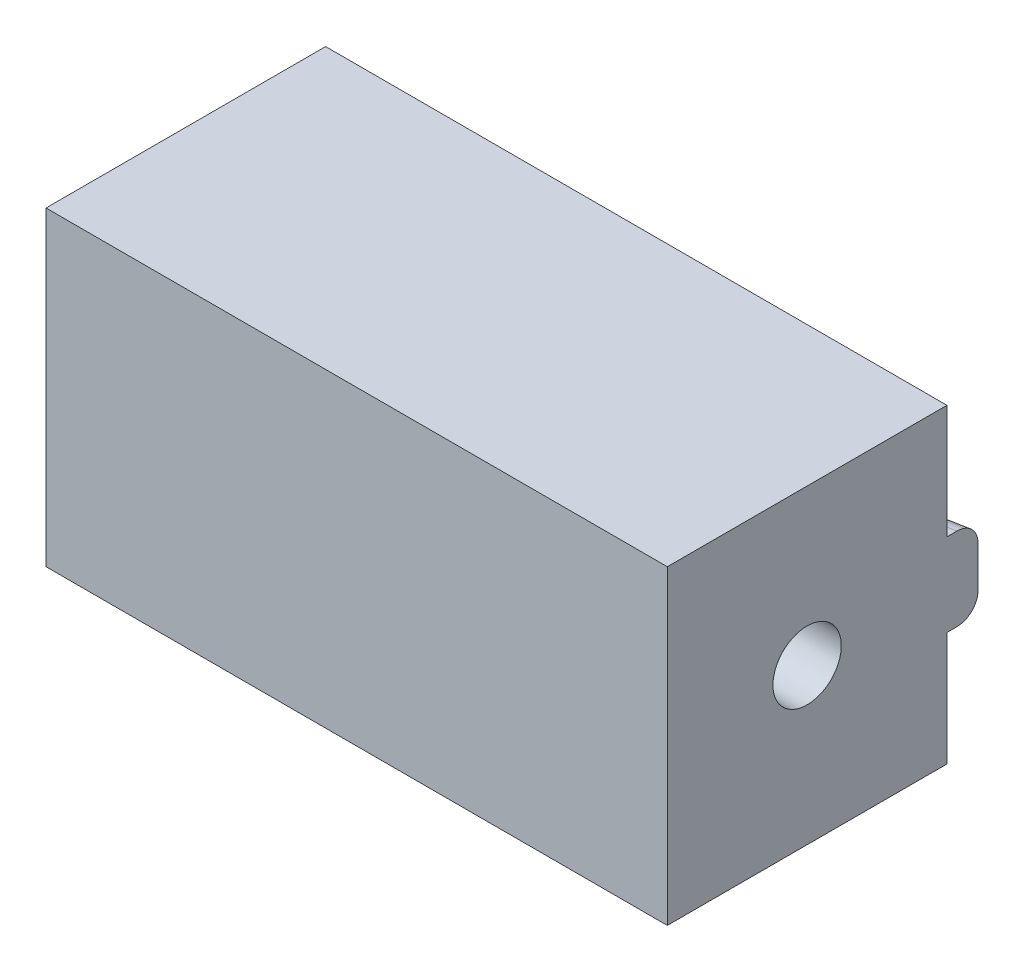
ISO-10303-21;
HEADER;
FILE_DESCRIPTION(('STEP AP214'),'2;1');
FILE_NAME('part.step','',(''),(''),'','','');
FILE_SCHEMA(('AUTOMOTIVE_DESIGN { 1 0 10303 214 1 1 1 1 }'));
ENDSEC;
DATA;
#1=APPLICATION_CONTEXT('core data for automotive mechanical design processes');
#2=APPLICATION_PROTOCOL_DEFINITION('international standard','automotive_design',2000,#1);
#3=PRODUCT_CONTEXT('',#1,'mechanical');
#4=PRODUCT('Part','Part','',(#3));
#5=PRODUCT_RELATED_PRODUCT_CATEGORY('part','',(#4));
#6=PRODUCT_DEFINITION_FORMATION('','',#4);
#7=PRODUCT_DEFINITION_CONTEXT('part definition',#1,'design');
#8=PRODUCT_DEFINITION('design','',#6,#7);
#9=PRODUCT_DEFINITION_SHAPE('','',#8);
#10=(LENGTH_UNIT() NAMED_UNIT(*) SI_UNIT(.MILLI.,.METRE.));
#11=(NAMED_UNIT(*) PLANE_ANGLE_UNIT() SI_UNIT($,.RADIAN.));
#12=(NAMED_UNIT(*) SI_UNIT($,.STERADIAN.) SOLID_ANGLE_UNIT());
#13=UNCERTAINTY_MEASURE_WITH_UNIT(LENGTH_MEASURE(1.E-05),#10,'distance_accuracy_value','');
#14=(GEOMETRIC_REPRESENTATION_CONTEXT(3) GLOBAL_UNCERTAINTY_ASSIGNED_CONTEXT((#13)) GLOBAL_UNIT_ASSIGNED_CONTEXT((#10,
#11,#12)) REPRESENTATION_CONTEXT('',''));
#15=CARTESIAN_POINT('',(0.,0.,0.));
#16=DIRECTION('',(0.,0.,1.));
#17=DIRECTION('',(1.,0.,0.));
#18=AXIS2_PLACEMENT_3D('',#15,#16,#17);
#19=CARTESIAN_POINT('',(0.,0.,-6.75));
#20=DIRECTION('',(0.,0.,-1.));
#21=DIRECTION('',(-1.,0.,0.));
#22=AXIS2_PLACEMENT_3D('',#19,#20,#21);
#23=PLANE('',#22);
#24=DIRECTION('',(1.,0.,0.));
#25=VECTOR('',#24,1.);
#26=CARTESIAN_POINT('',(22.,2.,-6.75));
#27=LINE('',#26,#25);
#28=CARTESIAN_POINT('',(27.4262735320332,2.,-6.75));
#29=VERTEX_POINT('',#28);
#30=CARTESIAN_POINT('',(30.,2.,-6.75));
#31=VERTEX_POINT('',#30);
#32=EDGE_CURVE('E111',#29,#31,#27,.T.);
#33=ORIENTED_EDGE('',*,*,#32,.F.);
#34=CARTESIAN_POINT('',(27.4262735320332,1.,-6.75));
#35=DIRECTION('',(0.,0.,-1.));
#36=DIRECTION('',(1.,0.,0.));
#37=AXIS2_PLACEMENT_3D('',#34,#35,#36);
#38=ELLIPSE('',#37,5.42627353203323,1.);
#39=CARTESIAN_POINT('',(22.,1.,-6.75));
#40=VERTEX_POINT('',#39);
#41=EDGE_CURVE('E48',#29,#40,#38,.F.);
#42=ORIENTED_EDGE('',*,*,#41,.T.);
#43=DIRECTION('',(0.,-1.,0.));
#44=VECTOR('',#43,1.);
#45=CARTESIAN_POINT('',(22.,2.,-6.75));
#46=LINE('',#45,#44);
#47=CARTESIAN_POINT('',(22.,-1.,-6.75));
#48=VERTEX_POINT('',#47);
#49=EDGE_CURVE('E130',#40,#48,#46,.T.);
#50=ORIENTED_EDGE('',*,*,#49,.T.);
#51=CARTESIAN_POINT('',(27.4262735320332,-1.,-6.75));
#52=DIRECTION('',(0.,0.,-1.));
#53=DIRECTION('',(-1.,0.,0.));
#54=AXIS2_PLACEMENT_3D('',#51,#52,#53);
#55=ELLIPSE('',#54,5.42627353203323,1.);
#56=CARTESIAN_POINT('',(27.4262735320332,-2.,-6.75));
#57=VERTEX_POINT('',#56);
#58=EDGE_CURVE('E11',#48,#57,#55,.F.);
#59=ORIENTED_EDGE('',*,*,#58,.T.);
#60=DIRECTION('',(1.,0.,0.));
#61=VECTOR('',#60,1.);
#62=CARTESIAN_POINT('',(22.,-2.,-6.75));
#63=LINE('',#62,#61);
#64=CARTESIAN_POINT('',(30.,-2.,-6.75));
#65=VERTEX_POINT('',#64);
#66=EDGE_CURVE('E239',#57,#65,#63,.T.);
#67=ORIENTED_EDGE('',*,*,#66,.T.);
#68=DIRECTION('',(0.,1.,0.));
#69=VECTOR('',#68,1.);
#70=CARTESIAN_POINT('',(30.,-7.5,-6.75));
#71=LINE('',#70,#69);
#72=CARTESIAN_POINT('',(30.,-7.5,-6.75));
#73=VERTEX_POINT('',#72);
#74=EDGE_CURVE('E136',#73,#65,#71,.T.);
#75=ORIENTED_EDGE('',*,*,#74,.F.);
#76=DIRECTION('',(1.,0.,0.));
#77=VECTOR('',#76,1.);
#78=CARTESIAN_POINT('',(0.,-7.5,-6.75));
#79=LINE('',#78,#77);
#80=CARTESIAN_POINT('',(0.,-7.5,-6.75));
#81=VERTEX_POINT('',#80);
#82=EDGE_CURVE('E137',#81,#73,#79,.T.);
#83=ORIENTED_EDGE('',*,*,#82,.F.);
#84=DIRECTION('',(0.,-1.,0.));
#85=VECTOR('',#84,1.);
#86=CARTESIAN_POINT('',(0.,-7.5,-6.75));
#87=LINE('',#86,#85);
#88=CARTESIAN_POINT('',(0.,7.5,-6.75));
#89=VERTEX_POINT('',#88);
#90=EDGE_CURVE('E142',#89,#81,#87,.T.);
#91=ORIENTED_EDGE('',*,*,#90,.F.);
#92=DIRECTION('',(-1.,0.,0.));
#93=VECTOR('',#92,1.);
#94=CARTESIAN_POINT('',(0.,7.5,-6.75));
#95=LINE('',#94,#93);
#96=CARTESIAN_POINT('',(30.,7.5,-6.75));
#97=VERTEX_POINT('',#96);
#98=EDGE_CURVE('E134',#97,#89,#95,.T.);
#99=ORIENTED_EDGE('',*,*,#98,.F.);
#100=EDGE_CURVE('E125',#31,#97,#71,.T.);
#101=ORIENTED_EDGE('',*,*,#100,.F.);
#102=EDGE_LOOP('',(#33,#42,#50,#59,#67,#75,#83,#91,#99,#101));
#103=FACE_BOUND('',#102,.T.);
#104=ADVANCED_FACE('F39',(#103),#23,.T.);
#105=CARTESIAN_POINT('',(0.,-7.5,6.75));
#106=DIRECTION('',(1.,0.,0.));
#107=DIRECTION('',(0.,1.,0.));
#108=AXIS2_PLACEMENT_3D('',#105,#106,#107);
#109=PLANE('',#108);
#110=CARTESIAN_POINT('',(0.,0.,0.));
#111=DIRECTION('',(-1.,0.,0.));
#112=DIRECTION('',(0.,0.,1.));
#113=AXIS2_PLACEMENT_3D('',#110,#111,#112);
#114=CIRCLE('',#113,3.);
#115=CARTESIAN_POINT('',(0.,0.,3.));
#116=VERTEX_POINT('',#115);
#117=EDGE_CURVE('E241',#116,#116,#114,.T.);
#118=ORIENTED_EDGE('',*,*,#117,.F.);
#119=EDGE_LOOP('',(#118));
#120=FACE_BOUND('',#119,.T.);
#121=ORIENTED_EDGE('',*,*,#90,.T.);
#122=DIRECTION('',(0.,0.,-1.));
#123=VECTOR('',#122,1.);
#124=CARTESIAN_POINT('',(0.,-7.5,6.75));
#125=LINE('',#124,#123);
#126=CARTESIAN_POINT('',(0.,-7.5,6.75));
#127=VERTEX_POINT('',#126);
#128=EDGE_CURVE('E161',#127,#81,#125,.T.);
#129=ORIENTED_EDGE('',*,*,#128,.F.);
#130=DIRECTION('',(0.,-1.,0.));
#131=VECTOR('',#130,1.);
#132=CARTESIAN_POINT('',(0.,-7.5,6.75));
#133=LINE('',#132,#131);
#134=CARTESIAN_POINT('',(0.,7.5,6.75));
#135=VERTEX_POINT('',#134);
#136=EDGE_CURVE('E148',#135,#127,#133,.T.);
#137=ORIENTED_EDGE('',*,*,#136,.F.);
#138=DIRECTION('',(0.,0.,-1.));
#139=VECTOR('',#138,1.);
#140=CARTESIAN_POINT('',(0.,7.5,6.75));
#141=LINE('',#140,#139);
#142=EDGE_CURVE('E149',#135,#89,#141,.T.);
#143=ORIENTED_EDGE('',*,*,#142,.T.);
#144=EDGE_LOOP('',(#121,#129,#137,#143));
#145=FACE_BOUND('',#144,.T.);
#146=ADVANCED_FACE('F203',(#120,#145),#109,.F.);
#147=CARTESIAN_POINT('',(0.,-7.5,6.75));
#148=DIRECTION('',(0.,1.,0.));
#149=DIRECTION('',(0.,0.,1.));
#150=AXIS2_PLACEMENT_3D('',#147,#148,#149);
#151=PLANE('',#150);
#152=CARTESIAN_POINT('',(8.,-7.5,0.));
#153=DIRECTION('',(0.,-1.,0.));
#154=DIRECTION('',(0.,0.,-1.));
#155=AXIS2_PLACEMENT_3D('',#152,#153,#154);
#156=CIRCLE('',#155,1.5);
#157=CARTESIAN_POINT('',(8.,-7.5,-1.5));
#158=VERTEX_POINT('',#157);
#159=EDGE_CURVE('E228',#158,#158,#156,.T.);
#160=ORIENTED_EDGE('',*,*,#159,.F.);
#161=EDGE_LOOP('',(#160));
#162=FACE_BOUND('',#161,.T.);
#163=CARTESIAN_POINT('',(23.,-7.5,0.));
#164=DIRECTION('',(0.,-1.,0.));
#165=DIRECTION('',(0.,0.,-1.));
#166=AXIS2_PLACEMENT_3D('',#163,#164,#165);
#167=CIRCLE('',#166,1.5);
#168=CARTESIAN_POINT('',(23.,-7.5,-1.5));
#169=VERTEX_POINT('',#168);
#170=EDGE_CURVE('E232',#169,#169,#167,.T.);
#171=ORIENTED_EDGE('',*,*,#170,.F.);
#172=EDGE_LOOP('',(#171));
#173=FACE_BOUND('',#172,.T.);
#174=ORIENTED_EDGE('',*,*,#82,.T.);
#175=DIRECTION('',(0.,0.,-1.));
#176=VECTOR('',#175,1.);
#177=CARTESIAN_POINT('',(30.,-7.5,6.75));
#178=LINE('',#177,#176);
#179=CARTESIAN_POINT('',(30.,-7.5,6.75));
#180=VERTEX_POINT('',#179);
#181=EDGE_CURVE('E157',#180,#73,#178,.T.);
#182=ORIENTED_EDGE('',*,*,#181,.F.);
#183=DIRECTION('',(1.,0.,0.));
#184=VECTOR('',#183,1.);
#185=CARTESIAN_POINT('',(0.,-7.5,6.75));
#186=LINE('',#185,#184);
#187=EDGE_CURVE('E264',#127,#180,#186,.T.);
#188=ORIENTED_EDGE('',*,*,#187,.F.);
#189=ORIENTED_EDGE('',*,*,#128,.T.);
#190=EDGE_LOOP('',(#174,#182,#188,#189));
#191=FACE_BOUND('',#190,.T.);
#192=ADVANCED_FACE('F208',(#162,#173,#191),#151,.F.);
#193=CARTESIAN_POINT('',(30.,-7.5,6.75));
#194=DIRECTION('',(-1.,0.,0.));
#195=DIRECTION('',(0.,0.,1.));
#196=AXIS2_PLACEMENT_3D('',#193,#194,#195);
#197=PLANE('',#196);
#198=CARTESIAN_POINT('',(30.,0.,0.));
#199=DIRECTION('',(-1.,0.,0.));
#200=DIRECTION('',(0.,0.,1.));
#201=AXIS2_PLACEMENT_3D('',#198,#199,#200);
#202=CIRCLE('',#201,1.65);
#203=CARTESIAN_POINT('',(30.,0.,1.65));
#204=VERTEX_POINT('',#203);
#205=EDGE_CURVE('E321',#204,#204,#202,.T.);
#206=ORIENTED_EDGE('',*,*,#205,.T.);
#207=EDGE_LOOP('',(#206));
#208=FACE_BOUND('',#207,.T.);
#209=DIRECTION('',(0.,-1.,0.));
#210=VECTOR('',#209,1.);
#211=CARTESIAN_POINT('',(30.,2.,-8.25));
#212=LINE('',#211,#210);
#213=CARTESIAN_POINT('',(30.,1.,-8.25));
#214=VERTEX_POINT('',#213);
#215=CARTESIAN_POINT('',(30.,-1.,-8.25));
#216=VERTEX_POINT('',#215);
#217=EDGE_CURVE('E189',#214,#216,#212,.T.);
#218=ORIENTED_EDGE('',*,*,#217,.F.);
#219=CARTESIAN_POINT('',(30.,1.,-7.23257371274377));
#220=DIRECTION('',(-1.,0.,0.));
#221=DIRECTION('',(0.,0.,-1.));
#222=AXIS2_PLACEMENT_3D('',#219,#220,#221);
#223=ELLIPSE('',#222,1.01742628725623,1.);
#224=CARTESIAN_POINT('',(30.,2.,-7.23257371274377));
#225=VERTEX_POINT('',#224);
#226=EDGE_CURVE('E128',#214,#225,#223,.F.);
#227=ORIENTED_EDGE('',*,*,#226,.T.);
#228=DIRECTION('',(0.,0.,-1.));
#229=VECTOR('',#228,1.);
#230=CARTESIAN_POINT('',(30.,2.,-6.75));
#231=LINE('',#230,#229);
#232=EDGE_CURVE('E114',#31,#225,#231,.T.);
#233=ORIENTED_EDGE('',*,*,#232,.F.);
#234=ORIENTED_EDGE('',*,*,#100,.T.);
#235=DIRECTION('',(0.,0.,-1.));
#236=VECTOR('',#235,1.);
#237=CARTESIAN_POINT('',(30.,7.5,6.75));
#238=LINE('',#237,#236);
#239=CARTESIAN_POINT('',(30.,7.5,6.75));
#240=VERTEX_POINT('',#239);
#241=EDGE_CURVE('E153',#240,#97,#238,.T.);
#242=ORIENTED_EDGE('',*,*,#241,.F.);
#243=DIRECTION('',(0.,1.,0.));
#244=VECTOR('',#243,1.);
#245=CARTESIAN_POINT('',(30.,-7.5,6.75));
#246=LINE('',#245,#244);
#247=EDGE_CURVE('E238',#180,#240,#246,.T.);
#248=ORIENTED_EDGE('',*,*,#247,.F.);
#249=ORIENTED_EDGE('',*,*,#181,.T.);
#250=ORIENTED_EDGE('',*,*,#74,.T.);
#251=DIRECTION('',(0.,0.,-1.));
#252=VECTOR('',#251,1.);
#253=CARTESIAN_POINT('',(30.,-2.,-6.75));
#254=LINE('',#253,#252);
#255=CARTESIAN_POINT('',(30.,-2.,-7.23257371274377));
#256=VERTEX_POINT('',#255);
#257=EDGE_CURVE('E119',#65,#256,#254,.T.);
#258=ORIENTED_EDGE('',*,*,#257,.T.);
#259=CARTESIAN_POINT('',(30.,-1.,-7.23257371274377));
#260=DIRECTION('',(-1.,0.,0.));
#261=DIRECTION('',(0.,0.,1.));
#262=AXIS2_PLACEMENT_3D('',#259,#260,#261);
#263=ELLIPSE('',#262,1.01742628725623,1.);
#264=EDGE_CURVE('E174',#256,#216,#263,.F.);
#265=ORIENTED_EDGE('',*,*,#264,.T.);
#266=EDGE_LOOP('',(#218,#227,#233,#234,#242,#248,#249,#250,#258,#265));
#267=FACE_BOUND('',#266,.T.);
#268=ADVANCED_FACE('F123',(#208,#267),#197,.F.);
#269=CARTESIAN_POINT('',(0.,7.5,6.75));
#270=DIRECTION('',(0.,-1.,0.));
#271=DIRECTION('',(1.,0.,0.));
#272=AXIS2_PLACEMENT_3D('',#269,#270,#271);
#273=PLANE('',#272);
#274=ORIENTED_EDGE('',*,*,#98,.T.);
#275=ORIENTED_EDGE('',*,*,#142,.F.);
#276=DIRECTION('',(-1.,0.,0.));
#277=VECTOR('',#276,1.);
#278=CARTESIAN_POINT('',(0.,7.5,6.75));
#279=LINE('',#278,#277);
#280=EDGE_CURVE('E154',#240,#135,#279,.T.);
#281=ORIENTED_EDGE('',*,*,#280,.F.);
#282=ORIENTED_EDGE('',*,*,#241,.T.);
#283=EDGE_LOOP('',(#274,#275,#281,#282));
#284=FACE_BOUND('',#283,.T.);
#285=ADVANCED_FACE('F214',(#284),#273,.F.);
#286=CARTESIAN_POINT('',(0.,0.,6.75));
#287=DIRECTION('',(0.,0.,-1.));
#288=DIRECTION('',(-1.,0.,0.));
#289=AXIS2_PLACEMENT_3D('',#286,#287,#288);
#290=PLANE('',#289);
#291=ORIENTED_EDGE('',*,*,#136,.T.);
#292=ORIENTED_EDGE('',*,*,#187,.T.);
#293=ORIENTED_EDGE('',*,*,#247,.T.);
#294=ORIENTED_EDGE('',*,*,#280,.T.);
#295=EDGE_LOOP('',(#291,#292,#293,#294));
#296=FACE_BOUND('',#295,.T.);
#297=ADVANCED_FACE('F212',(#296),#290,.F.);
#298=CARTESIAN_POINT('',(23.,-4.5,0.));
#299=DIRECTION('',(0.,-1.,0.));
#300=DIRECTION('',(0.,0.,-1.));
#301=AXIS2_PLACEMENT_3D('',#298,#299,#300);
#302=CYLINDRICAL_SURFACE('',#301,1.5);
#303=CARTESIAN_POINT('',(23.,-4.5,0.));
#304=DIRECTION('',(0.,-1.,0.));
#305=DIRECTION('',(0.,0.,-1.));
#306=AXIS2_PLACEMENT_3D('',#303,#304,#305);
#307=CIRCLE('',#306,1.5);
#308=CARTESIAN_POINT('',(23.,-4.5,-1.5));
#309=VERTEX_POINT('',#308);
#310=EDGE_CURVE('E255',#309,#309,#307,.T.);
#311=ORIENTED_EDGE('',*,*,#310,.F.);
#312=EDGE_LOOP('',(#311));
#313=FACE_BOUND('',#312,.T.);
#314=ORIENTED_EDGE('',*,*,#170,.T.);
#315=EDGE_LOOP('',(#314));
#316=FACE_BOUND('',#315,.T.);
#317=ADVANCED_FACE('F277',(#313,#316),#302,.F.);
#318=CARTESIAN_POINT('',(23.,-4.5,0.));
#319=DIRECTION('',(0.,-1.,0.));
#320=DIRECTION('',(0.,0.,-1.));
#321=AXIS2_PLACEMENT_3D('',#318,#319,#320);
#322=PLANE('',#321);
#323=ORIENTED_EDGE('',*,*,#310,.T.);
#324=EDGE_LOOP('',(#323));
#325=FACE_BOUND('',#324,.T.);
#326=ADVANCED_FACE('F281',(#325),#322,.T.);
#327=CARTESIAN_POINT('',(8.,-4.5,0.));
#328=DIRECTION('',(0.,-1.,0.));
#329=DIRECTION('',(0.,0.,-1.));
#330=AXIS2_PLACEMENT_3D('',#327,#328,#329);
#331=CYLINDRICAL_SURFACE('',#330,1.5);
#332=CARTESIAN_POINT('',(8.,-4.5,0.));
#333=DIRECTION('',(0.,-1.,0.));
#334=DIRECTION('',(0.,0.,-1.));
#335=AXIS2_PLACEMENT_3D('',#332,#333,#334);
#336=CIRCLE('',#335,1.5);
#337=CARTESIAN_POINT('',(8.,-4.5,-1.5));
#338=VERTEX_POINT('',#337);
#339=EDGE_CURVE('E249',#338,#338,#336,.T.);
#340=ORIENTED_EDGE('',*,*,#339,.F.);
#341=EDGE_LOOP('',(#340));
#342=FACE_BOUND('',#341,.T.);
#343=ORIENTED_EDGE('',*,*,#159,.T.);
#344=EDGE_LOOP('',(#343));
#345=FACE_BOUND('',#344,.T.);
#346=ADVANCED_FACE('F286',(#342,#345),#331,.F.);
#347=CARTESIAN_POINT('',(8.,-4.5,0.));
#348=DIRECTION('',(0.,-1.,0.));
#349=DIRECTION('',(0.,0.,-1.));
#350=AXIS2_PLACEMENT_3D('',#347,#348,#349);
#351=PLANE('',#350);
#352=ORIENTED_EDGE('',*,*,#339,.T.);
#353=EDGE_LOOP('',(#352));
#354=FACE_BOUND('',#353,.T.);
#355=ADVANCED_FACE('F294',(#354),#351,.T.);
#356=CARTESIAN_POINT('',(30.,2.,-8.25));
#357=DIRECTION('',(0.184288535050185,0.,0.982872186934322));
#358=DIRECTION('',(0.982872186934322,0.,-0.184288535050185));
#359=AXIS2_PLACEMENT_3D('',#356,#357,#358);
#360=PLANE('',#359);
#361=ORIENTED_EDGE('',*,*,#49,.F.);
#362=DIRECTION('',(-0.982872186934322,0.,0.184288535050185));
#363=VECTOR('',#362,1.);
#364=CARTESIAN_POINT('',(30.,1.,-8.25));
#365=LINE('',#364,#363);
#366=EDGE_CURVE('E171',#40,#214,#365,.F.);
#367=ORIENTED_EDGE('',*,*,#366,.T.);
#368=ORIENTED_EDGE('',*,*,#217,.T.);
#369=DIRECTION('',(-0.982872186934322,0.,0.184288535050185));
#370=VECTOR('',#369,1.);
#371=CARTESIAN_POINT('',(30.,-1.,-8.25));
#372=LINE('',#371,#370);
#373=EDGE_CURVE('E167',#216,#48,#372,.T.);
#374=ORIENTED_EDGE('',*,*,#373,.T.);
#375=EDGE_LOOP('',(#361,#367,#368,#374));
#376=FACE_BOUND('',#375,.T.);
#377=ADVANCED_FACE('F185',(#376),#360,.F.);
#378=CARTESIAN_POINT('',(0.,2.,0.));
#379=DIRECTION('',(0.,1.,0.));
#380=DIRECTION('',(0.,0.,1.));
#381=AXIS2_PLACEMENT_3D('',#378,#379,#380);
#382=PLANE('',#381);
#383=ORIENTED_EDGE('',*,*,#232,.T.);
#384=DIRECTION('',(-0.982872186934322,0.,0.184288535050185));
#385=VECTOR('',#384,1.);
#386=CARTESIAN_POINT('',(22.1842885350502,2.,-5.76712781306568));
#387=LINE('',#386,#385);
#388=EDGE_CURVE('E116',#225,#29,#387,.T.);
#389=ORIENTED_EDGE('',*,*,#388,.T.);
#390=ORIENTED_EDGE('',*,*,#32,.T.);
#391=EDGE_LOOP('',(#383,#389,#390));
#392=FACE_BOUND('',#391,.T.);
#393=ADVANCED_FACE('F113',(#392),#382,.T.);
#394=CARTESIAN_POINT('',(0.,-2.,0.));
#395=DIRECTION('',(0.,1.,0.));
#396=DIRECTION('',(0.,0.,1.));
#397=AXIS2_PLACEMENT_3D('',#394,#395,#396);
#398=PLANE('',#397);
#399=ORIENTED_EDGE('',*,*,#66,.F.);
#400=DIRECTION('',(-0.982872186934322,0.,0.184288535050185));
#401=VECTOR('',#400,1.);
#402=CARTESIAN_POINT('',(-0.291183163063022,-2.,-1.55297686966945));
#403=LINE('',#402,#401);
#404=EDGE_CURVE('E60',#57,#256,#403,.F.);
#405=ORIENTED_EDGE('',*,*,#404,.T.);
#406=ORIENTED_EDGE('',*,*,#257,.F.);
#407=EDGE_LOOP('',(#399,#405,#406));
#408=FACE_BOUND('',#407,.T.);
#409=ADVANCED_FACE('F193',(#408),#398,.F.);
#410=CARTESIAN_POINT('',(-0.291183163063022,1.,-1.55297686966945));
#411=DIRECTION('',(0.982872186934322,0.,-0.184288535050185));
#412=DIRECTION('',(-0.184288535050185,0.,-0.982872186934322));
#413=AXIS2_PLACEMENT_3D('',#410,#411,#412);
#414=CYLINDRICAL_SURFACE('',#413,1.);
#415=ORIENTED_EDGE('',*,*,#226,.F.);
#416=ORIENTED_EDGE('',*,*,#366,.F.);
#417=ORIENTED_EDGE('',*,*,#41,.F.);
#418=ORIENTED_EDGE('',*,*,#388,.F.);
#419=EDGE_LOOP('',(#415,#416,#417,#418));
#420=FACE_BOUND('',#419,.T.);
#421=ADVANCED_FACE('F191',(#420),#414,.T.);
#422=CARTESIAN_POINT('',(30.1842885350502,-1.,-7.26712781306568));
#423=DIRECTION('',(-0.982872186934322,0.,0.184288535050185));
#424=DIRECTION('',(0.184288535050185,0.,0.982872186934322));
#425=AXIS2_PLACEMENT_3D('',#422,#423,#424);
#426=CYLINDRICAL_SURFACE('',#425,1.);
#427=ORIENTED_EDGE('',*,*,#264,.F.);
#428=ORIENTED_EDGE('',*,*,#404,.F.);
#429=ORIENTED_EDGE('',*,*,#58,.F.);
#430=ORIENTED_EDGE('',*,*,#373,.F.);
#431=EDGE_LOOP('',(#427,#428,#429,#430));
#432=FACE_BOUND('',#431,.T.);
#433=ADVANCED_FACE('F41',(#432),#426,.T.);
#434=CARTESIAN_POINT('',(0.,0.,0.));
#435=DIRECTION('',(-1.,0.,0.));
#436=DIRECTION('',(0.,0.,1.));
#437=AXIS2_PLACEMENT_3D('',#434,#435,#436);
#438=CYLINDRICAL_SURFACE('',#437,3.);
#439=ORIENTED_EDGE('',*,*,#117,.T.);
#440=EDGE_LOOP('',(#439));
#441=FACE_BOUND('',#440,.T.);
#442=CARTESIAN_POINT('',(22.5,0.,0.));
#443=DIRECTION('',(-1.,0.,0.));
#444=DIRECTION('',(0.,0.,1.));
#445=AXIS2_PLACEMENT_3D('',#442,#443,#444);
#446=CIRCLE('',#445,3.);
#447=CARTESIAN_POINT('',(22.5,0.,3.));
#448=VERTEX_POINT('',#447);
#449=EDGE_CURVE('E325',#448,#448,#446,.T.);
#450=ORIENTED_EDGE('',*,*,#449,.F.);
#451=EDGE_LOOP('',(#450));
#452=FACE_BOUND('',#451,.T.);
#453=ADVANCED_FACE('F198',(#441,#452),#438,.F.);
#454=CARTESIAN_POINT('',(22.5,0.,-1.65));
#455=DIRECTION('',(-1.,0.,0.));
#456=DIRECTION('',(0.,0.,1.));
#457=AXIS2_PLACEMENT_3D('',#454,#455,#456);
#458=PLANE('',#457);
#459=ORIENTED_EDGE('',*,*,#449,.T.);
#460=EDGE_LOOP('',(#459));
#461=FACE_BOUND('',#460,.T.);
#462=CARTESIAN_POINT('',(22.5,0.,0.));
#463=DIRECTION('',(-1.,0.,0.));
#464=DIRECTION('',(0.,0.,1.));
#465=AXIS2_PLACEMENT_3D('',#462,#463,#464);
#466=CIRCLE('',#465,1.65);
#467=CARTESIAN_POINT('',(22.5,0.,1.65));
#468=VERTEX_POINT('',#467);
#469=EDGE_CURVE('E318',#468,#468,#466,.T.);
#470=ORIENTED_EDGE('',*,*,#469,.F.);
#471=EDGE_LOOP('',(#470));
#472=FACE_BOUND('',#471,.T.);
#473=ADVANCED_FACE('F305',(#461,#472),#458,.T.);
#474=CARTESIAN_POINT('',(0.,0.,0.));
#475=DIRECTION('',(-1.,0.,0.));
#476=DIRECTION('',(0.,0.,1.));
#477=AXIS2_PLACEMENT_3D('',#474,#475,#476);
#478=CYLINDRICAL_SURFACE('',#477,1.65);
#479=ORIENTED_EDGE('',*,*,#469,.T.);
#480=EDGE_LOOP('',(#479));
#481=FACE_BOUND('',#480,.T.);
#482=ORIENTED_EDGE('',*,*,#205,.F.);
#483=EDGE_LOOP('',(#482));
#484=FACE_BOUND('',#483,.T.);
#485=ADVANCED_FACE('F309',(#481,#484),#478,.F.);
#486=CLOSED_SHELL('',(#104,#146,#192,#268,#285,#297,#317,#326,#346,#355,#377,#393,#409,#421,
#433,#453,#473,#485));
#487=MANIFOLD_SOLID_BREP('B2',#486);
#488=ADVANCED_BREP_SHAPE_REPRESENTATION('',(#18,#487),#14);
#489=SHAPE_DEFINITION_REPRESENTATION(#9,#488);
ENDSEC;
END-ISO-10303-21;
